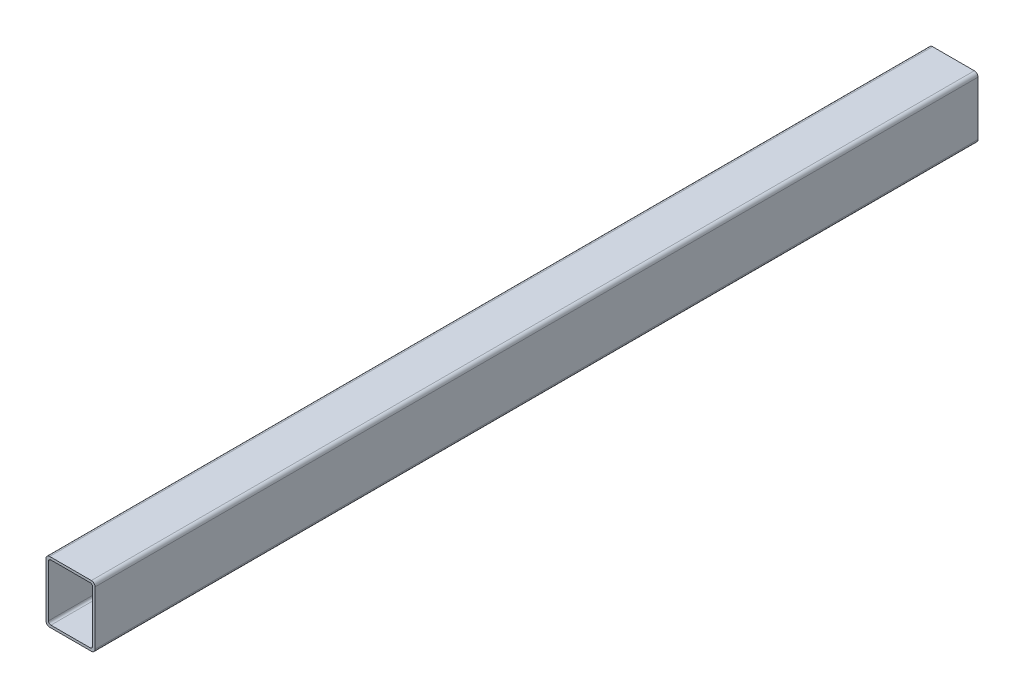
ISO-10303-21;
HEADER;
FILE_DESCRIPTION(('STEP AP214'),'2;1');
FILE_NAME('part.step','',(''),(''),'','','');
FILE_SCHEMA(('AUTOMOTIVE_DESIGN { 1 0 10303 214 1 1 1 1 }'));
ENDSEC;
DATA;
#1=APPLICATION_CONTEXT('core data for automotive mechanical design processes');
#2=APPLICATION_PROTOCOL_DEFINITION('international standard','automotive_design',2000,#1);
#3=PRODUCT_CONTEXT('',#1,'mechanical');
#4=PRODUCT('Part','Part','',(#3));
#5=PRODUCT_RELATED_PRODUCT_CATEGORY('part','',(#4));
#6=PRODUCT_DEFINITION_FORMATION('','',#4);
#7=PRODUCT_DEFINITION_CONTEXT('part definition',#1,'design');
#8=PRODUCT_DEFINITION('design','',#6,#7);
#9=PRODUCT_DEFINITION_SHAPE('','',#8);
#10=(LENGTH_UNIT() NAMED_UNIT(*) SI_UNIT(.MILLI.,.METRE.));
#11=(NAMED_UNIT(*) PLANE_ANGLE_UNIT() SI_UNIT($,.RADIAN.));
#12=(NAMED_UNIT(*) SI_UNIT($,.STERADIAN.) SOLID_ANGLE_UNIT());
#13=UNCERTAINTY_MEASURE_WITH_UNIT(LENGTH_MEASURE(1.E-05),#10,'distance_accuracy_value','');
#14=(GEOMETRIC_REPRESENTATION_CONTEXT(3) GLOBAL_UNCERTAINTY_ASSIGNED_CONTEXT((#13)) GLOBAL_UNIT_ASSIGNED_CONTEXT((#10,
#11,#12)) REPRESENTATION_CONTEXT('',''));
#15=CARTESIAN_POINT('',(0.,0.,0.));
#16=DIRECTION('',(0.,0.,1.));
#17=DIRECTION('',(1.,0.,0.));
#18=AXIS2_PLACEMENT_3D('',#15,#16,#17);
#19=CARTESIAN_POINT('',(-16.9999999999984,704.999999999999,-759.999999999996));
#20=DIRECTION('',(0.,1.,0.));
#21=DIRECTION('',(0.,0.,0.999999999999996));
#22=AXIS2_PLACEMENT_3D('',#19,#20,#21);
#23=PLANE('',#22);
#24=DIRECTION('',(0.999999999999994,0.,0.));
#25=VECTOR('',#24,1.);
#26=CARTESIAN_POINT('',(-16.9999999999993,704.999999999999,-20.0000000000003));
#27=LINE('',#26,#25);
#28=CARTESIAN_POINT('',(-16.9999999999993,704.999999999999,-20.0000000000003));
#29=VERTEX_POINT('',#28);
#30=CARTESIAN_POINT('',(17.0000000000001,705.,-19.9999999999997));
#31=VERTEX_POINT('',#30);
#32=EDGE_CURVE('E342',#29,#31,#27,.T.);
#33=ORIENTED_EDGE('',*,*,#32,.F.);
#34=DIRECTION('',(0.,0.,0.999999999999996));
#35=VECTOR('',#34,1.);
#36=CARTESIAN_POINT('',(-16.9999999999984,704.999999999999,-759.999999999996));
#37=LINE('',#36,#35);
#38=CARTESIAN_POINT('',(-16.9999999999977,704.999999999999,-739.999999999996));
#39=VERTEX_POINT('',#38);
#40=EDGE_CURVE('E226',#39,#29,#37,.T.);
#41=ORIENTED_EDGE('',*,*,#40,.F.);
#42=DIRECTION('',(-0.999999999999994,0.,0.));
#43=VECTOR('',#42,1.);
#44=CARTESIAN_POINT('',(-16.9999999999977,704.999999999999,-739.999999999996));
#45=LINE('',#44,#43);
#46=CARTESIAN_POINT('',(17.000000000001,704.999999999999,-739.999999999998));
#47=VERTEX_POINT('',#46);
#48=EDGE_CURVE('E212',#47,#39,#45,.T.);
#49=ORIENTED_EDGE('',*,*,#48,.F.);
#50=DIRECTION('',(0.,0.,0.999999999999996));
#51=VECTOR('',#50,1.);
#52=CARTESIAN_POINT('',(17.0000000000012,705.,-759.999999999996));
#53=LINE('',#52,#51);
#54=EDGE_CURVE('E209',#47,#31,#53,.T.);
#55=ORIENTED_EDGE('',*,*,#54,.T.);
#56=EDGE_LOOP('',(#33,#41,#49,#55));
#57=FACE_BOUND('',#56,.T.);
#58=ADVANCED_FACE('F47',(#57),#23,.F.);
#59=CARTESIAN_POINT('',(-16.9999999999972,754.999999999999,-759.999999999998));
#60=DIRECTION('',(0.,-1.,0.));
#61=DIRECTION('',(0.,0.,-0.999999999999996));
#62=AXIS2_PLACEMENT_3D('',#59,#60,#61);
#63=PLANE('',#62);
#64=DIRECTION('',(-0.999999999999994,0.,0.));
#65=VECTOR('',#64,1.);
#66=CARTESIAN_POINT('',(-16.9999999999986,754.999999999999,-20.0000000000004));
#67=LINE('',#66,#65);
#68=CARTESIAN_POINT('',(17.0000000000017,755.,-19.9999999999994));
#69=VERTEX_POINT('',#68);
#70=CARTESIAN_POINT('',(-16.9999999999986,754.999999999999,-20.0000000000004));
#71=VERTEX_POINT('',#70);
#72=EDGE_CURVE('E278',#69,#71,#67,.T.);
#73=ORIENTED_EDGE('',*,*,#72,.F.);
#74=DIRECTION('',(0.,0.,0.999999999999996));
#75=VECTOR('',#74,1.);
#76=CARTESIAN_POINT('',(17.0000000000017,755.,-759.999999999999));
#77=LINE('',#76,#75);
#78=CARTESIAN_POINT('',(17.0000000000026,754.999999999999,-739.999999999997));
#79=VERTEX_POINT('',#78);
#80=EDGE_CURVE('E224',#79,#69,#77,.T.);
#81=ORIENTED_EDGE('',*,*,#80,.F.);
#82=DIRECTION('',(0.999999999999994,0.,0.));
#83=VECTOR('',#82,1.);
#84=CARTESIAN_POINT('',(-16.9999999999979,754.999999999999,-739.999999999998));
#85=LINE('',#84,#83);
#86=CARTESIAN_POINT('',(-16.9999999999979,754.999999999999,-739.999999999998));
#87=VERTEX_POINT('',#86);
#88=EDGE_CURVE('E363',#87,#79,#85,.T.);
#89=ORIENTED_EDGE('',*,*,#88,.F.);
#90=DIRECTION('',(0.,0.,0.999999999999996));
#91=VECTOR('',#90,1.);
#92=CARTESIAN_POINT('',(-16.9999999999972,754.999999999999,-759.999999999998));
#93=LINE('',#92,#91);
#94=EDGE_CURVE('E233',#87,#71,#93,.T.);
#95=ORIENTED_EDGE('',*,*,#94,.T.);
#96=EDGE_LOOP('',(#73,#81,#89,#95));
#97=FACE_BOUND('',#96,.T.);
#98=ADVANCED_FACE('F358',(#97),#63,.F.);
#99=CARTESIAN_POINT('',(17.0000000000017,752.,-759.999999999999));
#100=DIRECTION('',(0.,0.,0.999999999999996));
#101=DIRECTION('',(0.999999999999994,0.,0.));
#102=AXIS2_PLACEMENT_3D('',#99,#100,#101);
#103=CYLINDRICAL_SURFACE('',#102,3.);
#104=CARTESIAN_POINT('',(17.0000000000017,752.,-19.9999999999994));
#105=DIRECTION('',(0.,0.,0.999999999999996));
#106=DIRECTION('',(0.999999999999994,0.,0.));
#107=AXIS2_PLACEMENT_3D('',#104,#105,#106);
#108=CIRCLE('',#107,3.);
#109=CARTESIAN_POINT('',(20.0000000000009,752.,-19.9999999999997));
#110=VERTEX_POINT('',#109);
#111=EDGE_CURVE('E285',#110,#69,#108,.T.);
#112=ORIENTED_EDGE('',*,*,#111,.F.);
#113=DIRECTION('',(0.,0.,0.999999999999996));
#114=VECTOR('',#113,1.);
#115=CARTESIAN_POINT('',(20.0000000000022,752.,-759.999999999999));
#116=LINE('',#115,#114);
#117=CARTESIAN_POINT('',(20.0000000000016,752.,-739.999999999999));
#118=VERTEX_POINT('',#117);
#119=EDGE_CURVE('E218',#118,#110,#116,.T.);
#120=ORIENTED_EDGE('',*,*,#119,.F.);
#121=CARTESIAN_POINT('',(17.0000000000026,751.999999999999,-739.999999999997));
#122=DIRECTION('',(0.,0.,-0.999999999999996));
#123=DIRECTION('',(-0.999999999999994,0.,0.));
#124=AXIS2_PLACEMENT_3D('',#121,#122,#123);
#125=CIRCLE('',#124,3.);
#126=EDGE_CURVE('E193',#79,#118,#125,.T.);
#127=ORIENTED_EDGE('',*,*,#126,.F.);
#128=ORIENTED_EDGE('',*,*,#80,.T.);
#129=EDGE_LOOP('',(#112,#120,#127,#128));
#130=FACE_BOUND('',#129,.T.);
#131=ADVANCED_FACE('F361',(#130),#103,.T.);
#132=CARTESIAN_POINT('',(-16.9999999999972,751.999999999999,-759.999999999998));
#133=DIRECTION('',(0.,0.,0.999999999999996));
#134=DIRECTION('',(0.999999999999994,0.,0.));
#135=AXIS2_PLACEMENT_3D('',#132,#133,#134);
#136=CYLINDRICAL_SURFACE('',#135,3.);
#137=CARTESIAN_POINT('',(-16.9999999999986,751.999999999999,-20.0000000000004));
#138=DIRECTION('',(0.,0.,0.999999999999996));
#139=DIRECTION('',(0.999999999999994,0.,0.));
#140=AXIS2_PLACEMENT_3D('',#137,#138,#139);
#141=CIRCLE('',#140,3.);
#142=CARTESIAN_POINT('',(-19.9999999999974,751.999999999999,-19.9999999999998));
#143=VERTEX_POINT('',#142);
#144=EDGE_CURVE('E271',#71,#143,#141,.T.);
#145=ORIENTED_EDGE('',*,*,#144,.F.);
#146=ORIENTED_EDGE('',*,*,#94,.F.);
#147=CARTESIAN_POINT('',(-16.9999999999979,751.999999999999,-739.999999999998));
#148=DIRECTION('',(0.,0.,-0.999999999999996));
#149=DIRECTION('',(-0.999999999999994,0.,0.));
#150=AXIS2_PLACEMENT_3D('',#147,#148,#149);
#151=CIRCLE('',#150,3.);
#152=CARTESIAN_POINT('',(-19.9999999999976,751.999999999998,-739.999999999999));
#153=VERTEX_POINT('',#152);
#154=EDGE_CURVE('E369',#153,#87,#151,.T.);
#155=ORIENTED_EDGE('',*,*,#154,.F.);
#156=DIRECTION('',(0.,0.,0.999999999999996));
#157=VECTOR('',#156,1.);
#158=CARTESIAN_POINT('',(-19.9999999999971,751.999999999999,-759.999999999998));
#159=LINE('',#158,#157);
#160=EDGE_CURVE('E237',#153,#143,#159,.T.);
#161=ORIENTED_EDGE('',*,*,#160,.T.);
#162=EDGE_LOOP('',(#145,#146,#155,#161));
#163=FACE_BOUND('',#162,.T.);
#164=ADVANCED_FACE('F443',(#163),#136,.T.);
#165=CARTESIAN_POINT('',(-15.9999999999985,708.999999999999,-759.999999999996));
#166=DIRECTION('',(0.,0.,0.999999999999996));
#167=DIRECTION('',(0.999999999999994,0.,0.));
#168=AXIS2_PLACEMENT_3D('',#165,#166,#167);
#169=CYLINDRICAL_SURFACE('',#168,2.);
#170=DIRECTION('',(0.,0.,0.999999999999996));
#171=VECTOR('',#170,1.);
#172=CARTESIAN_POINT('',(-17.9999999999989,708.999999999999,-759.999999999996));
#173=LINE('',#172,#171);
#174=CARTESIAN_POINT('',(-17.9999999999982,708.999999999999,-739.999999999997));
#175=VERTEX_POINT('',#174);
#176=CARTESIAN_POINT('',(-17.9999999999996,708.999999999999,-20.0000000000008));
#177=VERTEX_POINT('',#176);
#178=EDGE_CURVE('E244',#175,#177,#173,.T.);
#179=ORIENTED_EDGE('',*,*,#178,.T.);
#180=CARTESIAN_POINT('',(-15.9999999999989,708.999999999999,-20.0000000000003));
#181=DIRECTION('',(0.,0.,0.999999999999996));
#182=DIRECTION('',(0.999999999999994,0.,0.));
#183=AXIS2_PLACEMENT_3D('',#180,#181,#182);
#184=CIRCLE('',#183,2.);
#185=CARTESIAN_POINT('',(-15.999999999999,706.999999999999,-20.0000000000003));
#186=VERTEX_POINT('',#185);
#187=EDGE_CURVE('E333',#177,#186,#184,.T.);
#188=ORIENTED_EDGE('',*,*,#187,.T.);
#189=DIRECTION('',(0.,0.,0.999999999999996));
#190=VECTOR('',#189,1.);
#191=CARTESIAN_POINT('',(-15.9999999999985,706.999999999999,-759.999999999996));
#192=LINE('',#191,#190);
#193=CARTESIAN_POINT('',(-15.9999999999978,706.999999999999,-739.999999999996));
#194=VERTEX_POINT('',#193);
#195=EDGE_CURVE('E247',#194,#186,#192,.T.);
#196=ORIENTED_EDGE('',*,*,#195,.F.);
#197=CARTESIAN_POINT('',(-15.9999999999976,708.999999999999,-739.999999999996));
#198=DIRECTION('',(0.,0.,-0.999999999999996));
#199=DIRECTION('',(-0.999999999999994,0.,0.));
#200=AXIS2_PLACEMENT_3D('',#197,#198,#199);
#201=CIRCLE('',#200,2.);
#202=EDGE_CURVE('E415',#194,#175,#201,.T.);
#203=ORIENTED_EDGE('',*,*,#202,.T.);
#204=EDGE_LOOP('',(#179,#188,#196,#203));
#205=FACE_BOUND('',#204,.T.);
#206=ADVANCED_FACE('F446',(#205),#169,.F.);
#207=CARTESIAN_POINT('',(-15.9999999999985,706.999999999999,-759.999999999996));
#208=DIRECTION('',(0.,1.,0.));
#209=DIRECTION('',(0.,0.,0.999999999999996));
#210=AXIS2_PLACEMENT_3D('',#207,#208,#209);
#211=PLANE('',#210);
#212=ORIENTED_EDGE('',*,*,#195,.T.);
#213=DIRECTION('',(0.999999999999994,0.,0.));
#214=VECTOR('',#213,1.);
#215=CARTESIAN_POINT('',(-15.999999999999,706.999999999999,-20.0000000000003));
#216=LINE('',#215,#214);
#217=CARTESIAN_POINT('',(16.0000000000006,707.,-20.0000000000014));
#218=VERTEX_POINT('',#217);
#219=EDGE_CURVE('E327',#186,#218,#216,.T.);
#220=ORIENTED_EDGE('',*,*,#219,.T.);
#221=DIRECTION('',(0.,0.,0.999999999999996));
#222=VECTOR('',#221,1.);
#223=CARTESIAN_POINT('',(16.0000000000013,707.,-759.999999999996));
#224=LINE('',#223,#222);
#225=CARTESIAN_POINT('',(16.0000000000013,706.999999999999,-739.999999999996));
#226=VERTEX_POINT('',#225);
#227=EDGE_CURVE('E256',#226,#218,#224,.T.);
#228=ORIENTED_EDGE('',*,*,#227,.F.);
#229=DIRECTION('',(-0.999999999999994,0.,0.));
#230=VECTOR('',#229,1.);
#231=CARTESIAN_POINT('',(-15.9999999999978,706.999999999999,-739.999999999996));
#232=LINE('',#231,#230);
#233=EDGE_CURVE('E412',#226,#194,#232,.T.);
#234=ORIENTED_EDGE('',*,*,#233,.T.);
#235=EDGE_LOOP('',(#212,#220,#228,#234));
#236=FACE_BOUND('',#235,.T.);
#237=ADVANCED_FACE('F554',(#236),#211,.T.);
#238=CARTESIAN_POINT('',(16.0000000000013,709.,-759.999999999996));
#239=DIRECTION('',(0.,0.,0.999999999999996));
#240=DIRECTION('',(0.999999999999994,0.,0.));
#241=AXIS2_PLACEMENT_3D('',#238,#239,#240);
#242=CYLINDRICAL_SURFACE('',#241,2.);
#243=ORIENTED_EDGE('',*,*,#227,.T.);
#244=CARTESIAN_POINT('',(16.0000000000007,709.,-20.0000000000014));
#245=DIRECTION('',(0.,0.,0.999999999999996));
#246=DIRECTION('',(0.999999999999994,0.,0.));
#247=AXIS2_PLACEMENT_3D('',#244,#245,#246);
#248=CIRCLE('',#247,2.);
#249=CARTESIAN_POINT('',(18.0000000000005,709.,-19.9999999999995));
#250=VERTEX_POINT('',#249);
#251=EDGE_CURVE('E324',#218,#250,#248,.T.);
#252=ORIENTED_EDGE('',*,*,#251,.T.);
#253=DIRECTION('',(0.,0.,0.999999999999996));
#254=VECTOR('',#253,1.);
#255=CARTESIAN_POINT('',(18.0000000000011,709.,-759.999999999997));
#256=LINE('',#255,#254);
#257=CARTESIAN_POINT('',(18.0000000000002,709.,-739.999999999996));
#258=VERTEX_POINT('',#257);
#259=EDGE_CURVE('E266',#258,#250,#256,.T.);
#260=ORIENTED_EDGE('',*,*,#259,.F.);
#261=CARTESIAN_POINT('',(16.0000000000013,708.999999999999,-739.999999999996));
#262=DIRECTION('',(0.,0.,-0.999999999999996));
#263=DIRECTION('',(-0.999999999999994,0.,0.));
#264=AXIS2_PLACEMENT_3D('',#261,#262,#263);
#265=CIRCLE('',#264,2.);
#266=EDGE_CURVE('E322',#258,#226,#265,.T.);
#267=ORIENTED_EDGE('',*,*,#266,.T.);
#268=EDGE_LOOP('',(#243,#252,#260,#267));
#269=FACE_BOUND('',#268,.T.);
#270=ADVANCED_FACE('F321',(#269),#242,.F.);
#271=CARTESIAN_POINT('',(18.0000000000011,709.,-759.999999999997));
#272=DIRECTION('',(-0.999999999999994,0.,0.));
#273=DIRECTION('',(0.,0.,0.999999999999996));
#274=AXIS2_PLACEMENT_3D('',#271,#272,#273);
#275=PLANE('',#274);
#276=ORIENTED_EDGE('',*,*,#259,.T.);
#277=DIRECTION('',(0.,1.,0.));
#278=VECTOR('',#277,1.);
#279=CARTESIAN_POINT('',(18.0000000000005,709.,-19.9999999999995));
#280=LINE('',#279,#278);
#281=CARTESIAN_POINT('',(18.0000000000022,751.,-20.0000000000001));
#282=VERTEX_POINT('',#281);
#283=EDGE_CURVE('E316',#250,#282,#280,.T.);
#284=ORIENTED_EDGE('',*,*,#283,.T.);
#285=DIRECTION('',(0.,0.,0.999999999999996));
#286=VECTOR('',#285,1.);
#287=CARTESIAN_POINT('',(18.0000000000016,751.,-759.999999999999));
#288=LINE('',#287,#286);
#289=CARTESIAN_POINT('',(18.0000000000027,751.,-739.999999999999));
#290=VERTEX_POINT('',#289);
#291=EDGE_CURVE('E303',#290,#282,#288,.T.);
#292=ORIENTED_EDGE('',*,*,#291,.F.);
#293=DIRECTION('',(0.,-1.,0.));
#294=VECTOR('',#293,1.);
#295=CARTESIAN_POINT('',(18.0000000000002,709.,-739.999999999996));
#296=LINE('',#295,#294);
#297=EDGE_CURVE('E317',#290,#258,#296,.T.);
#298=ORIENTED_EDGE('',*,*,#297,.T.);
#299=EDGE_LOOP('',(#276,#284,#292,#298));
#300=FACE_BOUND('',#299,.T.);
#301=ADVANCED_FACE('F314',(#300),#275,.T.);
#302=CARTESIAN_POINT('',(16.0000000000016,751.,-759.999999999998));
#303=DIRECTION('',(0.,0.,0.999999999999996));
#304=DIRECTION('',(0.999999999999994,0.,0.));
#305=AXIS2_PLACEMENT_3D('',#302,#303,#304);
#306=CYLINDRICAL_SURFACE('',#305,2.);
#307=ORIENTED_EDGE('',*,*,#291,.T.);
#308=CARTESIAN_POINT('',(16.0000000000016,751.,-20.0000000000006));
#309=DIRECTION('',(0.,0.,0.999999999999996));
#310=DIRECTION('',(0.999999999999994,0.,0.));
#311=AXIS2_PLACEMENT_3D('',#308,#309,#310);
#312=CIRCLE('',#311,2.);
#313=CARTESIAN_POINT('',(16.0000000000016,753.,-20.0000000000006));
#314=VERTEX_POINT('',#313);
#315=EDGE_CURVE('E335',#282,#314,#312,.T.);
#316=ORIENTED_EDGE('',*,*,#315,.T.);
#317=DIRECTION('',(0.,0.,0.999999999999996));
#318=VECTOR('',#317,1.);
#319=CARTESIAN_POINT('',(16.0000000000016,753.,-759.999999999998));
#320=LINE('',#319,#318);
#321=CARTESIAN_POINT('',(16.0000000000027,752.999999999999,-739.999999999999));
#322=VERTEX_POINT('',#321);
#323=EDGE_CURVE('E299',#322,#314,#320,.T.);
#324=ORIENTED_EDGE('',*,*,#323,.F.);
#325=CARTESIAN_POINT('',(16.0000000000027,750.999999999999,-739.999999999999));
#326=DIRECTION('',(0.,0.,-0.999999999999996));
#327=DIRECTION('',(-0.999999999999994,0.,0.));
#328=AXIS2_PLACEMENT_3D('',#325,#326,#327);
#329=CIRCLE('',#328,2.);
#330=EDGE_CURVE('E398',#322,#290,#329,.T.);
#331=ORIENTED_EDGE('',*,*,#330,.T.);
#332=EDGE_LOOP('',(#307,#316,#324,#331));
#333=FACE_BOUND('',#332,.T.);
#334=ADVANCED_FACE('F388',(#333),#306,.F.);
#335=CARTESIAN_POINT('',(-15.9999999999982,752.999999999999,-759.999999999998));
#336=DIRECTION('',(0.,-1.,0.));
#337=DIRECTION('',(0.,0.,-0.999999999999996));
#338=AXIS2_PLACEMENT_3D('',#335,#336,#337);
#339=PLANE('',#338);
#340=ORIENTED_EDGE('',*,*,#323,.T.);
#341=DIRECTION('',(-0.999999999999994,0.,0.));
#342=VECTOR('',#341,1.);
#343=CARTESIAN_POINT('',(-15.9999999999978,752.999999999999,-19.9999999999997));
#344=LINE('',#343,#342);
#345=CARTESIAN_POINT('',(-15.9999999999978,752.999999999999,-19.9999999999997));
#346=VERTEX_POINT('',#345);
#347=EDGE_CURVE('E379',#314,#346,#344,.T.);
#348=ORIENTED_EDGE('',*,*,#347,.T.);
#349=DIRECTION('',(0.,0.,0.999999999999996));
#350=VECTOR('',#349,1.);
#351=CARTESIAN_POINT('',(-15.9999999999982,752.999999999999,-759.999999999998));
#352=LINE('',#351,#350);
#353=CARTESIAN_POINT('',(-15.9999999999969,752.999999999999,-739.999999999998));
#354=VERTEX_POINT('',#353);
#355=EDGE_CURVE('E295',#354,#346,#352,.T.);
#356=ORIENTED_EDGE('',*,*,#355,.F.);
#357=DIRECTION('',(0.999999999999994,0.,0.));
#358=VECTOR('',#357,1.);
#359=CARTESIAN_POINT('',(-15.9999999999969,752.999999999999,-739.999999999998));
#360=LINE('',#359,#358);
#361=EDGE_CURVE('E394',#354,#322,#360,.T.);
#362=ORIENTED_EDGE('',*,*,#361,.T.);
#363=EDGE_LOOP('',(#340,#348,#356,#362));
#364=FACE_BOUND('',#363,.T.);
#365=ADVANCED_FACE('F392',(#364),#339,.T.);
#366=CARTESIAN_POINT('',(-15.9999999999976,750.999999999999,-759.999999999998));
#367=DIRECTION('',(0.,0.,0.999999999999996));
#368=DIRECTION('',(0.999999999999994,0.,0.));
#369=AXIS2_PLACEMENT_3D('',#366,#367,#368);
#370=CYLINDRICAL_SURFACE('',#369,2.);
#371=ORIENTED_EDGE('',*,*,#355,.T.);
#372=CARTESIAN_POINT('',(-15.9999999999978,750.999999999999,-19.9999999999997));
#373=DIRECTION('',(0.,0.,0.999999999999996));
#374=DIRECTION('',(0.999999999999994,0.,0.));
#375=AXIS2_PLACEMENT_3D('',#372,#373,#374);
#376=CIRCLE('',#375,2.);
#377=CARTESIAN_POINT('',(-17.9999999999996,750.999999999999,-20.0000000000007));
#378=VERTEX_POINT('',#377);
#379=EDGE_CURVE('E375',#346,#378,#376,.T.);
#380=ORIENTED_EDGE('',*,*,#379,.T.);
#381=DIRECTION('',(0.,0.,0.999999999999996));
#382=VECTOR('',#381,1.);
#383=CARTESIAN_POINT('',(-17.9999999999985,750.999999999999,-759.999999999999));
#384=LINE('',#383,#382);
#385=CARTESIAN_POINT('',(-17.9999999999976,750.999999999999,-739.999999999999));
#386=VERTEX_POINT('',#385);
#387=EDGE_CURVE('E292',#386,#378,#384,.T.);
#388=ORIENTED_EDGE('',*,*,#387,.F.);
#389=CARTESIAN_POINT('',(-15.9999999999969,750.999999999999,-739.999999999998));
#390=DIRECTION('',(0.,0.,-0.999999999999996));
#391=DIRECTION('',(-0.999999999999994,0.,0.));
#392=AXIS2_PLACEMENT_3D('',#389,#390,#391);
#393=CIRCLE('',#392,2.);
#394=EDGE_CURVE('E399',#386,#354,#393,.T.);
#395=ORIENTED_EDGE('',*,*,#394,.T.);
#396=EDGE_LOOP('',(#371,#380,#388,#395));
#397=FACE_BOUND('',#396,.T.);
#398=ADVANCED_FACE('F542',(#397),#370,.F.);
#399=CARTESIAN_POINT('',(-17.9999999999989,708.999999999999,-759.999999999996));
#400=DIRECTION('',(0.999999999999994,0.,0.));
#401=DIRECTION('',(0.,0.,-0.999999999999996));
#402=AXIS2_PLACEMENT_3D('',#399,#400,#401);
#403=PLANE('',#402);
#404=ORIENTED_EDGE('',*,*,#387,.T.);
#405=DIRECTION('',(0.,-1.,0.));
#406=VECTOR('',#405,1.);
#407=CARTESIAN_POINT('',(-17.9999999999996,708.999999999999,-20.0000000000008));
#408=LINE('',#407,#406);
#409=EDGE_CURVE('E11',#378,#177,#408,.T.);
#410=ORIENTED_EDGE('',*,*,#409,.T.);
#411=ORIENTED_EDGE('',*,*,#178,.F.);
#412=DIRECTION('',(0.,1.,0.));
#413=VECTOR('',#412,1.);
#414=CARTESIAN_POINT('',(-17.9999999999982,708.999999999999,-739.999999999997));
#415=LINE('',#414,#413);
#416=EDGE_CURVE('E56',#175,#386,#415,.T.);
#417=ORIENTED_EDGE('',*,*,#416,.T.);
#418=EDGE_LOOP('',(#404,#410,#411,#417));
#419=FACE_BOUND('',#418,.T.);
#420=ADVANCED_FACE('F441',(#419),#403,.T.);
#421=CARTESIAN_POINT('',(20.0000000000013,708.,-759.999999999997));
#422=DIRECTION('',(-0.999999999999994,0.,0.));
#423=DIRECTION('',(0.,0.,0.999999999999996));
#424=AXIS2_PLACEMENT_3D('',#421,#422,#423);
#425=PLANE('',#424);
#426=DIRECTION('',(0.,-1.,0.));
#427=VECTOR('',#426,1.);
#428=CARTESIAN_POINT('',(20.0000000000002,1460.,-19.9999999999999));
#429=LINE('',#428,#427);
#430=CARTESIAN_POINT('',(20.0000000000004,708.,-20.));
#431=VERTEX_POINT('',#430);
#432=EDGE_CURVE('E216',#110,#431,#429,.T.);
#433=ORIENTED_EDGE('',*,*,#432,.T.);
#434=DIRECTION('',(0.,0.,0.999999999999996));
#435=VECTOR('',#434,1.);
#436=CARTESIAN_POINT('',(20.0000000000013,708.,-759.999999999997));
#437=LINE('',#436,#435);
#438=CARTESIAN_POINT('',(20.0000000000013,708.,-739.999999999997));
#439=VERTEX_POINT('',#438);
#440=EDGE_CURVE('E207',#439,#431,#437,.T.);
#441=ORIENTED_EDGE('',*,*,#440,.F.);
#442=DIRECTION('',(0.,1.,0.));
#443=VECTOR('',#442,1.);
#444=CARTESIAN_POINT('',(20.0000000000009,-1.55431223447522E-12,-739.999999999998));
#445=LINE('',#444,#443);
#446=EDGE_CURVE('E190',#439,#118,#445,.T.);
#447=ORIENTED_EDGE('',*,*,#446,.T.);
#448=ORIENTED_EDGE('',*,*,#119,.T.);
#449=EDGE_LOOP('',(#433,#441,#447,#448));
#450=FACE_BOUND('',#449,.T.);
#451=ADVANCED_FACE('F215',(#450),#425,.F.);
#452=CARTESIAN_POINT('',(-15.4999999999981,-2.22044604925031E-13,-739.999999999997));
#453=DIRECTION('',(0.,0.,-0.999999999999996));
#454=DIRECTION('',(-0.999999999999994,0.,0.));
#455=AXIS2_PLACEMENT_3D('',#452,#453,#454);
#456=PLANE('',#455);
#457=ORIENTED_EDGE('',*,*,#233,.F.);
#458=ORIENTED_EDGE('',*,*,#266,.F.);
#459=ORIENTED_EDGE('',*,*,#297,.F.);
#460=ORIENTED_EDGE('',*,*,#330,.F.);
#461=ORIENTED_EDGE('',*,*,#361,.F.);
#462=ORIENTED_EDGE('',*,*,#394,.F.);
#463=ORIENTED_EDGE('',*,*,#416,.F.);
#464=ORIENTED_EDGE('',*,*,#202,.F.);
#465=EDGE_LOOP('',(#457,#458,#459,#460,#461,#462,#463,#464));
#466=FACE_BOUND('',#465,.T.);
#467=ORIENTED_EDGE('',*,*,#154,.T.);
#468=ORIENTED_EDGE('',*,*,#88,.T.);
#469=ORIENTED_EDGE('',*,*,#126,.T.);
#470=ORIENTED_EDGE('',*,*,#446,.F.);
#471=CARTESIAN_POINT('',(17.000000000001,707.999999999999,-739.999999999998));
#472=DIRECTION('',(0.,0.,-0.999999999999996));
#473=DIRECTION('',(-0.999999999999994,0.,0.));
#474=AXIS2_PLACEMENT_3D('',#471,#472,#473);
#475=CIRCLE('',#474,3.);
#476=EDGE_CURVE('E77',#439,#47,#475,.T.);
#477=ORIENTED_EDGE('',*,*,#476,.T.);
#478=ORIENTED_EDGE('',*,*,#48,.T.);
#479=CARTESIAN_POINT('',(-16.9999999999977,707.999999999999,-739.999999999996));
#480=DIRECTION('',(0.,0.,-0.999999999999996));
#481=DIRECTION('',(-0.999999999999994,0.,0.));
#482=AXIS2_PLACEMENT_3D('',#479,#480,#481);
#483=CIRCLE('',#482,3.);
#484=CARTESIAN_POINT('',(-19.9999999999987,707.999999999998,-739.999999999996));
#485=VERTEX_POINT('',#484);
#486=EDGE_CURVE('E211',#39,#485,#483,.T.);
#487=ORIENTED_EDGE('',*,*,#486,.T.);
#488=DIRECTION('',(0.,1.,0.));
#489=VECTOR('',#488,1.);
#490=CARTESIAN_POINT('',(-19.9999999999978,-2.22044604925031E-13,-739.999999999997));
#491=LINE('',#490,#489);
#492=EDGE_CURVE('E200',#485,#153,#491,.T.);
#493=ORIENTED_EDGE('',*,*,#492,.T.);
#494=EDGE_LOOP('',(#467,#468,#469,#470,#477,#478,#487,#493));
#495=FACE_BOUND('',#494,.T.);
#496=ADVANCED_FACE('F191',(#466,#495),#456,.T.);
#497=CARTESIAN_POINT('',(-19.9999999999978,707.999999999999,-759.999999999995));
#498=DIRECTION('',(0.999999999999994,0.,0.));
#499=DIRECTION('',(0.,0.,-0.999999999999996));
#500=AXIS2_PLACEMENT_3D('',#497,#498,#499);
#501=PLANE('',#500);
#502=DIRECTION('',(0.,-1.,0.));
#503=VECTOR('',#502,1.);
#504=CARTESIAN_POINT('',(-19.999999999999,1460.,-20.0000000000008));
#505=LINE('',#504,#503);
#506=CARTESIAN_POINT('',(-19.9999999999985,707.999999999999,-20.));
#507=VERTEX_POINT('',#506);
#508=EDGE_CURVE('E199',#143,#507,#505,.T.);
#509=ORIENTED_EDGE('',*,*,#508,.F.);
#510=ORIENTED_EDGE('',*,*,#160,.F.);
#511=ORIENTED_EDGE('',*,*,#492,.F.);
#512=DIRECTION('',(0.,0.,0.999999999999996));
#513=VECTOR('',#512,1.);
#514=CARTESIAN_POINT('',(-19.9999999999978,707.999999999999,-759.999999999995));
#515=LINE('',#514,#513);
#516=EDGE_CURVE('E241',#485,#507,#515,.T.);
#517=ORIENTED_EDGE('',*,*,#516,.T.);
#518=EDGE_LOOP('',(#509,#510,#511,#517));
#519=FACE_BOUND('',#518,.T.);
#520=ADVANCED_FACE('F448',(#519),#501,.F.);
#521=CARTESIAN_POINT('',(-15.4999999999992,1460.,-20.0000000000008));
#522=DIRECTION('',(0.,0.,0.999999999999996));
#523=DIRECTION('',(0.999999999999994,0.,0.));
#524=AXIS2_PLACEMENT_3D('',#521,#522,#523);
#525=PLANE('',#524);
#526=ORIENTED_EDGE('',*,*,#409,.F.);
#527=ORIENTED_EDGE('',*,*,#379,.F.);
#528=ORIENTED_EDGE('',*,*,#347,.F.);
#529=ORIENTED_EDGE('',*,*,#315,.F.);
#530=ORIENTED_EDGE('',*,*,#283,.F.);
#531=ORIENTED_EDGE('',*,*,#251,.F.);
#532=ORIENTED_EDGE('',*,*,#219,.F.);
#533=ORIENTED_EDGE('',*,*,#187,.F.);
#534=EDGE_LOOP('',(#526,#527,#528,#529,#530,#531,#532,#533));
#535=FACE_BOUND('',#534,.T.);
#536=ORIENTED_EDGE('',*,*,#144,.T.);
#537=ORIENTED_EDGE('',*,*,#508,.T.);
#538=CARTESIAN_POINT('',(-16.9999999999991,707.999999999999,-20.0000000000005));
#539=DIRECTION('',(0.,0.,0.999999999999996));
#540=DIRECTION('',(0.999999999999994,0.,0.));
#541=AXIS2_PLACEMENT_3D('',#538,#539,#540);
#542=CIRCLE('',#541,3.);
#543=EDGE_CURVE('E66',#507,#29,#542,.T.);
#544=ORIENTED_EDGE('',*,*,#543,.T.);
#545=ORIENTED_EDGE('',*,*,#32,.T.);
#546=CARTESIAN_POINT('',(17.0000000000001,708.,-19.9999999999997));
#547=DIRECTION('',(0.,0.,0.999999999999996));
#548=DIRECTION('',(0.999999999999994,0.,0.));
#549=AXIS2_PLACEMENT_3D('',#546,#547,#548);
#550=CIRCLE('',#549,3.);
#551=EDGE_CURVE('E345',#31,#431,#550,.T.);
#552=ORIENTED_EDGE('',*,*,#551,.T.);
#553=ORIENTED_EDGE('',*,*,#432,.F.);
#554=ORIENTED_EDGE('',*,*,#111,.T.);
#555=ORIENTED_EDGE('',*,*,#72,.T.);
#556=EDGE_LOOP('',(#536,#537,#544,#545,#552,#553,#554,#555));
#557=FACE_BOUND('',#556,.T.);
#558=ADVANCED_FACE('F354',(#535,#557),#525,.T.);
#559=CARTESIAN_POINT('',(-16.9999999999984,707.999999999999,-759.999999999996));
#560=DIRECTION('',(0.,0.,0.999999999999996));
#561=DIRECTION('',(0.999999999999994,0.,0.));
#562=AXIS2_PLACEMENT_3D('',#559,#560,#561);
#563=CYLINDRICAL_SURFACE('',#562,3.);
#564=ORIENTED_EDGE('',*,*,#543,.F.);
#565=ORIENTED_EDGE('',*,*,#516,.F.);
#566=ORIENTED_EDGE('',*,*,#486,.F.);
#567=ORIENTED_EDGE('',*,*,#40,.T.);
#568=EDGE_LOOP('',(#564,#565,#566,#567));
#569=FACE_BOUND('',#568,.T.);
#570=ADVANCED_FACE('F49',(#569),#563,.T.);
#571=CARTESIAN_POINT('',(17.0000000000012,708.,-759.999999999996));
#572=DIRECTION('',(0.,0.,0.999999999999996));
#573=DIRECTION('',(0.999999999999994,0.,0.));
#574=AXIS2_PLACEMENT_3D('',#571,#572,#573);
#575=CYLINDRICAL_SURFACE('',#574,3.);
#576=ORIENTED_EDGE('',*,*,#551,.F.);
#577=ORIENTED_EDGE('',*,*,#54,.F.);
#578=ORIENTED_EDGE('',*,*,#476,.F.);
#579=ORIENTED_EDGE('',*,*,#440,.T.);
#580=EDGE_LOOP('',(#576,#577,#578,#579));
#581=FACE_BOUND('',#580,.T.);
#582=ADVANCED_FACE('F206',(#581),#575,.T.);
#583=CLOSED_SHELL('',(#58,#98,#131,#164,#206,#237,#270,#301,#334,#365,#398,#420,#451,#496,#520,
#558,#570,#582));
#584=MANIFOLD_SOLID_BREP('B2',#583);
#585=ADVANCED_BREP_SHAPE_REPRESENTATION('',(#18,#584),#14);
#586=SHAPE_DEFINITION_REPRESENTATION(#9,#585);
ENDSEC;
END-ISO-10303-21;
